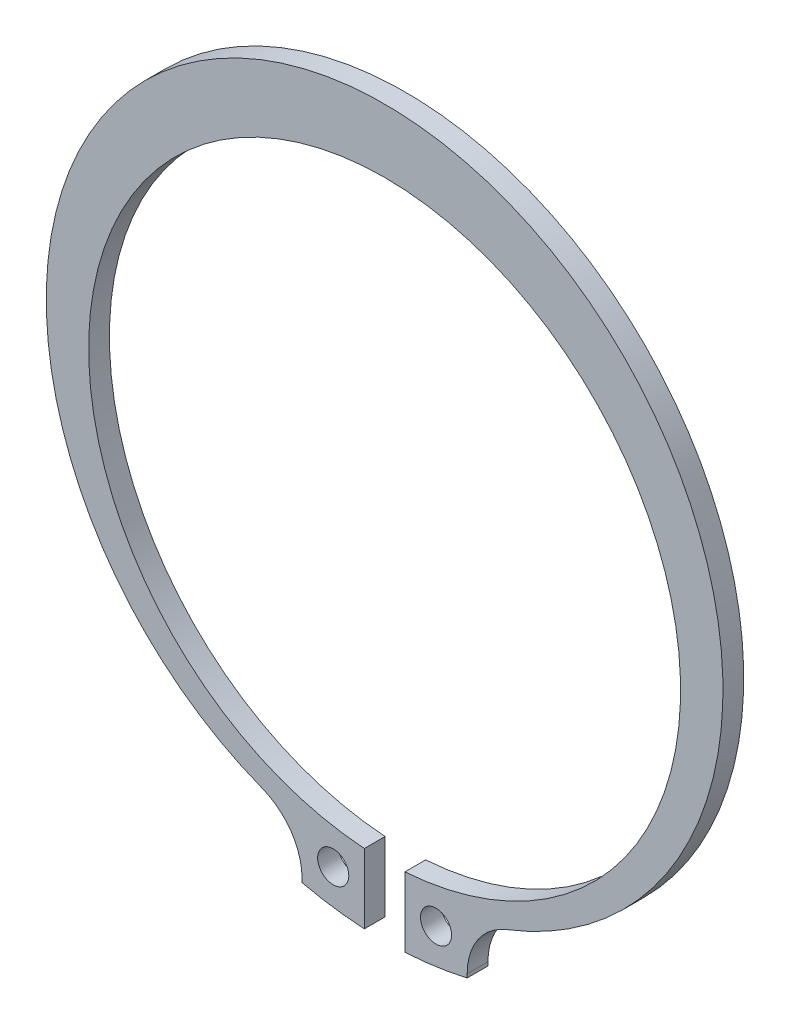
ISO-10303-21;
HEADER;
FILE_DESCRIPTION(('STEP AP214'),'2;1');
FILE_NAME('part.step','',(''),(''),'','','');
FILE_SCHEMA(('AUTOMOTIVE_DESIGN { 1 0 10303 214 1 1 1 1 }'));
ENDSEC;
DATA;
#1=APPLICATION_CONTEXT('core data for automotive mechanical design processes');
#2=APPLICATION_PROTOCOL_DEFINITION('international standard','automotive_design',2000,#1);
#3=PRODUCT_CONTEXT('',#1,'mechanical');
#4=PRODUCT('Part','Part','',(#3));
#5=PRODUCT_RELATED_PRODUCT_CATEGORY('part','',(#4));
#6=PRODUCT_DEFINITION_FORMATION('','',#4);
#7=PRODUCT_DEFINITION_CONTEXT('part definition',#1,'design');
#8=PRODUCT_DEFINITION('design','',#6,#7);
#9=PRODUCT_DEFINITION_SHAPE('','',#8);
#10=(LENGTH_UNIT() NAMED_UNIT(*) SI_UNIT(.MILLI.,.METRE.));
#11=(NAMED_UNIT(*) PLANE_ANGLE_UNIT() SI_UNIT($,.RADIAN.));
#12=(NAMED_UNIT(*) SI_UNIT($,.STERADIAN.) SOLID_ANGLE_UNIT());
#13=UNCERTAINTY_MEASURE_WITH_UNIT(LENGTH_MEASURE(1.E-05),#10,'distance_accuracy_value','');
#14=(GEOMETRIC_REPRESENTATION_CONTEXT(3) GLOBAL_UNCERTAINTY_ASSIGNED_CONTEXT((#13)) GLOBAL_UNIT_ASSIGNED_CONTEXT((#10,
#11,#12)) REPRESENTATION_CONTEXT('',''));
#15=CARTESIAN_POINT('',(0.,0.,0.));
#16=DIRECTION('',(0.,0.,1.));
#17=DIRECTION('',(1.,0.,0.));
#18=AXIS2_PLACEMENT_3D('',#15,#16,#17);
#19=CARTESIAN_POINT('',(9.9,-5.85070601971,0.));
#20=DIRECTION('',(1.,0.,0.));
#21=DIRECTION('',(0.,0.,-1.));
#22=AXIS2_PLACEMENT_3D('',#19,#20,#21);
#23=PLANE('',#22);
#24=DIRECTION('',(0.,0.,1.));
#25=VECTOR('',#24,1.);
#26=CARTESIAN_POINT('',(9.89999999998941,-5.8507060196643,0.));
#27=LINE('',#26,#25);
#28=CARTESIAN_POINT('',(9.89999999999471,-5.85070601966307,0.));
#29=VERTEX_POINT('',#28);
#30=CARTESIAN_POINT('',(9.89999999999471,-5.85070601966307,2.));
#31=VERTEX_POINT('',#30);
#32=EDGE_CURVE('E96',#29,#31,#27,.T.);
#33=ORIENTED_EDGE('',*,*,#32,.F.);
#34=DIRECTION('',(0.,1.,0.));
#35=VECTOR('',#34,1.);
#36=CARTESIAN_POINT('',(9.9,0.,0.));
#37=LINE('',#36,#35);
#38=CARTESIAN_POINT('',(9.9,-5.49641347023,0.));
#39=VERTEX_POINT('',#38);
#40=EDGE_CURVE('E99',#29,#39,#37,.T.);
#41=ORIENTED_EDGE('',*,*,#40,.T.);
#42=DIRECTION('',(0.,0.,1.));
#43=VECTOR('',#42,1.);
#44=CARTESIAN_POINT('',(9.9,-5.49641347023,0.));
#45=LINE('',#44,#43);
#46=CARTESIAN_POINT('',(9.9,-5.49641347023,2.));
#47=VERTEX_POINT('',#46);
#48=EDGE_CURVE('E119',#39,#47,#45,.T.);
#49=ORIENTED_EDGE('',*,*,#48,.T.);
#50=DIRECTION('',(0.,1.,0.));
#51=VECTOR('',#50,1.);
#52=CARTESIAN_POINT('',(9.9,-5.85070601971,2.));
#53=LINE('',#52,#51);
#54=EDGE_CURVE('E101',#47,#31,#53,.F.);
#55=ORIENTED_EDGE('',*,*,#54,.T.);
#56=EDGE_LOOP('',(#33,#41,#49,#55));
#57=FACE_BOUND('',#56,.T.);
#58=ADVANCED_FACE('F17',(#57),#23,.T.);
#59=CARTESIAN_POINT('',(-6.,-5.49641347023,0.));
#60=DIRECTION('',(-1.,0.,0.));
#61=DIRECTION('',(0.,0.,1.));
#62=AXIS2_PLACEMENT_3D('',#59,#60,#61);
#63=PLANE('',#62);
#64=DIRECTION('',(0.,0.,1.));
#65=VECTOR('',#64,1.);
#66=CARTESIAN_POINT('',(-6.,-5.49641347023,0.));
#67=LINE('',#66,#65);
#68=CARTESIAN_POINT('',(-6.,-5.49641347023,2.));
#69=VERTEX_POINT('',#68);
#70=CARTESIAN_POINT('',(-6.,-5.49641347023,0.));
#71=VERTEX_POINT('',#70);
#72=EDGE_CURVE('E175',#69,#71,#67,.F.);
#73=ORIENTED_EDGE('',*,*,#72,.T.);
#74=DIRECTION('',(0.,1.,0.));
#75=VECTOR('',#74,1.);
#76=CARTESIAN_POINT('',(-6.,0.,0.));
#77=LINE('',#76,#75);
#78=CARTESIAN_POINT('',(-5.99999999999471,-5.85070601966307,0.));
#79=VERTEX_POINT('',#78);
#80=EDGE_CURVE('E115',#71,#79,#77,.F.);
#81=ORIENTED_EDGE('',*,*,#80,.T.);
#82=DIRECTION('',(0.,0.,1.));
#83=VECTOR('',#82,1.);
#84=CARTESIAN_POINT('',(-5.99999999998942,-5.85070601966429,0.));
#85=LINE('',#84,#83);
#86=CARTESIAN_POINT('',(-5.99999999999471,-5.85070601966307,2.));
#87=VERTEX_POINT('',#86);
#88=EDGE_CURVE('E162',#87,#79,#85,.F.);
#89=ORIENTED_EDGE('',*,*,#88,.F.);
#90=DIRECTION('',(0.,1.,0.));
#91=VECTOR('',#90,1.);
#92=CARTESIAN_POINT('',(-6.,-5.49641347023,2.));
#93=LINE('',#92,#91);
#94=EDGE_CURVE('E116',#87,#69,#93,.T.);
#95=ORIENTED_EDGE('',*,*,#94,.T.);
#96=EDGE_LOOP('',(#73,#81,#89,#95));
#97=FACE_BOUND('',#96,.T.);
#98=ADVANCED_FACE('F211',(#97),#63,.T.);
#99=CARTESIAN_POINT('',(0.,0.,0.));
#100=DIRECTION('',(0.,0.,1.));
#101=DIRECTION('',(1.,0.,0.));
#102=AXIS2_PLACEMENT_3D('',#99,#100,#101);
#103=PLANE('',#102);
#104=CARTESIAN_POINT('',(6.9,-3.02654355576,0.));
#105=DIRECTION('',(0.,0.,-1.));
#106=DIRECTION('',(-1.,0.,0.));
#107=AXIS2_PLACEMENT_3D('',#104,#105,#106);
#108=CIRCLE('',#107,1.5);
#109=CARTESIAN_POINT('',(5.4,-3.02654355576,0.));
#110=VERTEX_POINT('',#109);
#111=EDGE_CURVE('E152',#110,#110,#108,.F.);
#112=ORIENTED_EDGE('',*,*,#111,.T.);
#113=EDGE_LOOP('',(#112));
#114=FACE_BOUND('',#113,.T.);
#115=CARTESIAN_POINT('',(-3.,-3.02654355576,0.));
#116=DIRECTION('',(0.,0.,1.));
#117=DIRECTION('',(1.,0.,0.));
#118=AXIS2_PLACEMENT_3D('',#115,#116,#117);
#119=CIRCLE('',#118,1.5);
#120=CARTESIAN_POINT('',(-1.5,-3.02654355576,0.));
#121=VERTEX_POINT('',#120);
#122=EDGE_CURVE('E155',#121,#121,#119,.T.);
#123=ORIENTED_EDGE('',*,*,#122,.T.);
#124=EDGE_LOOP('',(#123));
#125=FACE_BOUND('',#124,.T.);
#126=CARTESIAN_POINT('',(1.95,28.4332112151,0.));
#127=DIRECTION('',(0.,0.,1.));
#128=DIRECTION('',(1.,0.,0.));
#129=AXIS2_PLACEMENT_3D('',#126,#127,#128);
#130=CIRCLE('',#129,35.1936);
#131=CARTESIAN_POINT('',(0.,-6.7063246520891,0.));
#132=VERTEX_POINT('',#131);
#133=EDGE_CURVE('E160',#79,#132,#130,.T.);
#134=ORIENTED_EDGE('',*,*,#133,.F.);
#135=ORIENTED_EDGE('',*,*,#80,.F.);
#136=CARTESIAN_POINT('',(-12.,-5.49641347023,0.));
#137=DIRECTION('',(0.,0.,1.));
#138=DIRECTION('',(1.,0.,0.));
#139=AXIS2_PLACEMENT_3D('',#136,#137,#138);
#140=CIRCLE('',#139,6.);
#141=CARTESIAN_POINT('',(-9.83048211508956,0.0976183626302442,0.));
#142=VERTEX_POINT('',#141);
#143=EDGE_CURVE('E163',#71,#142,#140,.T.);
#144=ORIENTED_EDGE('',*,*,#143,.T.);
#145=CARTESIAN_POINT('',(1.95,30.4732112151,0.));
#146=DIRECTION('',(0.,0.,1.));
#147=DIRECTION('',(1.,0.,0.));
#148=AXIS2_PLACEMENT_3D('',#145,#146,#147);
#149=CIRCLE('',#148,32.58);
#150=CARTESIAN_POINT('',(13.7304821150857,0.0976183626530914,0.));
#151=VERTEX_POINT('',#150);
#152=EDGE_CURVE('E166',#151,#142,#149,.T.);
#153=ORIENTED_EDGE('',*,*,#152,.F.);
#154=CARTESIAN_POINT('',(15.9,-5.49641347023,0.));
#155=DIRECTION('',(0.,0.,1.));
#156=DIRECTION('',(1.,0.,0.));
#157=AXIS2_PLACEMENT_3D('',#154,#155,#156);
#158=CIRCLE('',#157,6.);
#159=EDGE_CURVE('E113',#151,#39,#158,.T.);
#160=ORIENTED_EDGE('',*,*,#159,.T.);
#161=ORIENTED_EDGE('',*,*,#40,.F.);
#162=CARTESIAN_POINT('',(1.95,28.4332112151,0.));
#163=DIRECTION('',(0.,0.,1.));
#164=DIRECTION('',(1.,0.,0.));
#165=AXIS2_PLACEMENT_3D('',#162,#163,#164);
#166=CIRCLE('',#165,35.1936);
#167=CARTESIAN_POINT('',(3.89999999999884,-6.70632465206826,0.));
#168=VERTEX_POINT('',#167);
#169=EDGE_CURVE('E20',#168,#29,#166,.T.);
#170=ORIENTED_EDGE('',*,*,#169,.F.);
#171=DIRECTION('',(0.,1.,0.));
#172=VECTOR('',#171,1.);
#173=CARTESIAN_POINT('',(3.9,0.,0.));
#174=LINE('',#173,#172);
#175=CARTESIAN_POINT('',(3.8999999999985,4.36543162729564E-11,0.));
#176=VERTEX_POINT('',#175);
#177=EDGE_CURVE('E91',#176,#168,#174,.F.);
#178=ORIENTED_EDGE('',*,*,#177,.F.);
#179=CARTESIAN_POINT('',(1.95,28.4332112151,0.));
#180=DIRECTION('',(0.,0.,1.));
#181=DIRECTION('',(1.,0.,0.));
#182=AXIS2_PLACEMENT_3D('',#179,#180,#181);
#183=CIRCLE('',#182,28.5);
#184=CARTESIAN_POINT('',(1.49294639151254E-12,4.36543162729564E-11,0.));
#185=VERTEX_POINT('',#184);
#186=EDGE_CURVE('E127',#176,#185,#183,.T.);
#187=ORIENTED_EDGE('',*,*,#186,.T.);
#188=DIRECTION('',(0.,1.,0.));
#189=VECTOR('',#188,1.);
#190=CARTESIAN_POINT('',(0.,-6.70632465211,0.));
#191=LINE('',#190,#189);
#192=EDGE_CURVE('E125',#132,#185,#191,.T.);
#193=ORIENTED_EDGE('',*,*,#192,.F.);
#194=EDGE_LOOP('',(#134,#135,#144,#153,#160,#161,#170,#178,#187,#193));
#195=FACE_BOUND('',#194,.T.);
#196=ADVANCED_FACE('F110',(#114,#125,#195),#103,.F.);
#197=CARTESIAN_POINT('',(3.9,0.,0.));
#198=DIRECTION('',(-1.,0.,0.));
#199=DIRECTION('',(0.,0.,1.));
#200=AXIS2_PLACEMENT_3D('',#197,#198,#199);
#201=PLANE('',#200);
#202=DIRECTION('',(0.,0.,1.));
#203=VECTOR('',#202,1.);
#204=CARTESIAN_POINT('',(3.899999999997,4.35519675878737E-11,0.));
#205=LINE('',#204,#203);
#206=CARTESIAN_POINT('',(3.8999999999985,4.36543162729564E-11,2.));
#207=VERTEX_POINT('',#206);
#208=EDGE_CURVE('E158',#207,#176,#205,.F.);
#209=ORIENTED_EDGE('',*,*,#208,.T.);
#210=ORIENTED_EDGE('',*,*,#177,.T.);
#211=DIRECTION('',(0.,0.,1.));
#212=VECTOR('',#211,1.);
#213=CARTESIAN_POINT('',(3.89999999999767,-6.70632465206833,0.));
#214=LINE('',#213,#212);
#215=CARTESIAN_POINT('',(3.89999999999884,-6.70632465206826,2.));
#216=VERTEX_POINT('',#215);
#217=EDGE_CURVE('E106',#216,#168,#214,.F.);
#218=ORIENTED_EDGE('',*,*,#217,.F.);
#219=DIRECTION('',(0.,1.,0.));
#220=VECTOR('',#219,1.);
#221=CARTESIAN_POINT('',(3.9,0.,2.));
#222=LINE('',#221,#220);
#223=EDGE_CURVE('E151',#207,#216,#222,.F.);
#224=ORIENTED_EDGE('',*,*,#223,.F.);
#225=EDGE_LOOP('',(#209,#210,#218,#224));
#226=FACE_BOUND('',#225,.T.);
#227=ADVANCED_FACE('F200',(#226),#201,.T.);
#228=CARTESIAN_POINT('',(1.95,28.4332112151,0.));
#229=DIRECTION('',(0.,0.,1.));
#230=DIRECTION('',(1.,0.,0.));
#231=AXIS2_PLACEMENT_3D('',#228,#229,#230);
#232=CYLINDRICAL_SURFACE('',#231,35.1936);
#233=ORIENTED_EDGE('',*,*,#217,.T.);
#234=ORIENTED_EDGE('',*,*,#169,.T.);
#235=ORIENTED_EDGE('',*,*,#32,.T.);
#236=CARTESIAN_POINT('',(1.95,28.4332112151,2.));
#237=DIRECTION('',(0.,0.,1.));
#238=DIRECTION('',(1.,0.,0.));
#239=AXIS2_PLACEMENT_3D('',#236,#237,#238);
#240=CIRCLE('',#239,35.1936);
#241=EDGE_CURVE('E149',#216,#31,#240,.T.);
#242=ORIENTED_EDGE('',*,*,#241,.F.);
#243=EDGE_LOOP('',(#233,#234,#235,#242));
#244=FACE_BOUND('',#243,.T.);
#245=ADVANCED_FACE('F118',(#244),#232,.T.);
#246=CARTESIAN_POINT('',(15.9,-5.49641347023,0.));
#247=DIRECTION('',(0.,0.,1.));
#248=DIRECTION('',(1.,0.,0.));
#249=AXIS2_PLACEMENT_3D('',#246,#247,#248);
#250=CYLINDRICAL_SURFACE('',#249,6.);
#251=CARTESIAN_POINT('',(15.9,-5.49641347023,2.));
#252=DIRECTION('',(0.,0.,1.));
#253=DIRECTION('',(1.,0.,0.));
#254=AXIS2_PLACEMENT_3D('',#251,#252,#253);
#255=CIRCLE('',#254,6.);
#256=CARTESIAN_POINT('',(13.7304821150775,0.0976183626742455,2.));
#257=VERTEX_POINT('',#256);
#258=EDGE_CURVE('E146',#47,#257,#255,.F.);
#259=ORIENTED_EDGE('',*,*,#258,.F.);
#260=ORIENTED_EDGE('',*,*,#48,.F.);
#261=ORIENTED_EDGE('',*,*,#159,.F.);
#262=DIRECTION('',(0.,0.,1.));
#263=VECTOR('',#262,1.);
#264=CARTESIAN_POINT('',(13.7304821150834,0.0976183626765111,0.));
#265=LINE('',#264,#263);
#266=EDGE_CURVE('E168',#257,#151,#265,.F.);
#267=ORIENTED_EDGE('',*,*,#266,.F.);
#268=EDGE_LOOP('',(#259,#260,#261,#267));
#269=FACE_BOUND('',#268,.T.);
#270=ADVANCED_FACE('F203',(#269),#250,.F.);
#271=CARTESIAN_POINT('',(1.95,30.4732112151,0.));
#272=DIRECTION('',(0.,0.,1.));
#273=DIRECTION('',(1.,0.,0.));
#274=AXIS2_PLACEMENT_3D('',#271,#272,#273);
#275=CYLINDRICAL_SURFACE('',#274,32.58);
#276=ORIENTED_EDGE('',*,*,#266,.T.);
#277=ORIENTED_EDGE('',*,*,#152,.T.);
#278=DIRECTION('',(0.,0.,1.));
#279=VECTOR('',#278,1.);
#280=CARTESIAN_POINT('',(-9.83048211509104,0.0976183626308167,0.));
#281=LINE('',#280,#279);
#282=CARTESIAN_POINT('',(-9.83048211508956,0.0976183626302442,2.));
#283=VERTEX_POINT('',#282);
#284=EDGE_CURVE('E165',#142,#283,#281,.T.);
#285=ORIENTED_EDGE('',*,*,#284,.T.);
#286=CARTESIAN_POINT('',(1.95,30.4732112151,2.));
#287=DIRECTION('',(0.,0.,1.));
#288=DIRECTION('',(1.,0.,0.));
#289=AXIS2_PLACEMENT_3D('',#286,#287,#288);
#290=CIRCLE('',#289,32.58);
#291=EDGE_CURVE('E143',#257,#283,#290,.T.);
#292=ORIENTED_EDGE('',*,*,#291,.F.);
#293=EDGE_LOOP('',(#276,#277,#285,#292));
#294=FACE_BOUND('',#293,.T.);
#295=ADVANCED_FACE('F204',(#294),#275,.T.);
#296=CARTESIAN_POINT('',(-12.,-5.49641347023,0.));
#297=DIRECTION('',(0.,0.,1.));
#298=DIRECTION('',(1.,0.,0.));
#299=AXIS2_PLACEMENT_3D('',#296,#297,#298);
#300=CYLINDRICAL_SURFACE('',#299,6.);
#301=CARTESIAN_POINT('',(-12.,-5.49641347023,2.));
#302=DIRECTION('',(0.,0.,1.));
#303=DIRECTION('',(1.,0.,0.));
#304=AXIS2_PLACEMENT_3D('',#301,#302,#303);
#305=CIRCLE('',#304,6.);
#306=EDGE_CURVE('E140',#283,#69,#305,.F.);
#307=ORIENTED_EDGE('',*,*,#306,.F.);
#308=ORIENTED_EDGE('',*,*,#284,.F.);
#309=ORIENTED_EDGE('',*,*,#143,.F.);
#310=ORIENTED_EDGE('',*,*,#72,.F.);
#311=EDGE_LOOP('',(#307,#308,#309,#310));
#312=FACE_BOUND('',#311,.T.);
#313=ADVANCED_FACE('F208',(#312),#300,.F.);
#314=CARTESIAN_POINT('',(1.95,28.4332112151,0.));
#315=DIRECTION('',(0.,0.,1.));
#316=DIRECTION('',(1.,0.,0.));
#317=AXIS2_PLACEMENT_3D('',#314,#315,#316);
#318=CYLINDRICAL_SURFACE('',#317,35.1936);
#319=ORIENTED_EDGE('',*,*,#88,.T.);
#320=ORIENTED_EDGE('',*,*,#133,.T.);
#321=DIRECTION('',(0.,0.,-1.));
#322=VECTOR('',#321,1.);
#323=CARTESIAN_POINT('',(0.,-6.70632465211,0.));
#324=LINE('',#323,#322);
#325=CARTESIAN_POINT('',(0.,-6.7063246520891,2.));
#326=VERTEX_POINT('',#325);
#327=EDGE_CURVE('E128',#326,#132,#324,.T.);
#328=ORIENTED_EDGE('',*,*,#327,.F.);
#329=CARTESIAN_POINT('',(1.95,28.4332112151,2.));
#330=DIRECTION('',(0.,0.,1.));
#331=DIRECTION('',(1.,0.,0.));
#332=AXIS2_PLACEMENT_3D('',#329,#330,#331);
#333=CIRCLE('',#332,35.1936);
#334=EDGE_CURVE('E137',#87,#326,#333,.T.);
#335=ORIENTED_EDGE('',*,*,#334,.F.);
#336=EDGE_LOOP('',(#319,#320,#328,#335));
#337=FACE_BOUND('',#336,.T.);
#338=ADVANCED_FACE('F194',(#337),#318,.T.);
#339=CARTESIAN_POINT('',(0.,-6.70632465211,0.));
#340=DIRECTION('',(1.,0.,0.));
#341=DIRECTION('',(0.,0.,-1.));
#342=AXIS2_PLACEMENT_3D('',#339,#340,#341);
#343=PLANE('',#342);
#344=ORIENTED_EDGE('',*,*,#327,.T.);
#345=ORIENTED_EDGE('',*,*,#192,.T.);
#346=DIRECTION('',(0.,0.,1.));
#347=VECTOR('',#346,1.);
#348=CARTESIAN_POINT('',(2.98589278302508E-12,4.35519675878737E-11,0.));
#349=LINE('',#348,#347);
#350=CARTESIAN_POINT('',(1.49294639151254E-12,4.36543162729564E-11,2.));
#351=VERTEX_POINT('',#350);
#352=EDGE_CURVE('E35',#185,#351,#349,.T.);
#353=ORIENTED_EDGE('',*,*,#352,.T.);
#354=DIRECTION('',(0.,1.,0.));
#355=VECTOR('',#354,1.);
#356=CARTESIAN_POINT('',(0.,0.,2.));
#357=LINE('',#356,#355);
#358=EDGE_CURVE('E136',#326,#351,#357,.T.);
#359=ORIENTED_EDGE('',*,*,#358,.F.);
#360=EDGE_LOOP('',(#344,#345,#353,#359));
#361=FACE_BOUND('',#360,.T.);
#362=ADVANCED_FACE('F191',(#361),#343,.T.);
#363=CARTESIAN_POINT('',(1.95,28.4332112151,0.));
#364=DIRECTION('',(0.,0.,1.));
#365=DIRECTION('',(1.,0.,0.));
#366=AXIS2_PLACEMENT_3D('',#363,#364,#365);
#367=CYLINDRICAL_SURFACE('',#366,28.5);
#368=CARTESIAN_POINT('',(1.95,28.4332112151,2.));
#369=DIRECTION('',(0.,0.,1.));
#370=DIRECTION('',(1.,0.,0.));
#371=AXIS2_PLACEMENT_3D('',#368,#369,#370);
#372=CIRCLE('',#371,28.5);
#373=EDGE_CURVE('E133',#351,#207,#372,.F.);
#374=ORIENTED_EDGE('',*,*,#373,.F.);
#375=ORIENTED_EDGE('',*,*,#352,.F.);
#376=ORIENTED_EDGE('',*,*,#186,.F.);
#377=ORIENTED_EDGE('',*,*,#208,.F.);
#378=EDGE_LOOP('',(#374,#375,#376,#377));
#379=FACE_BOUND('',#378,.T.);
#380=ADVANCED_FACE('F199',(#379),#367,.F.);
#381=CARTESIAN_POINT('',(-3.,-3.02654355576,2.));
#382=DIRECTION('',(0.,0.,1.));
#383=DIRECTION('',(1.,0.,0.));
#384=AXIS2_PLACEMENT_3D('',#381,#382,#383);
#385=CYLINDRICAL_SURFACE('',#384,1.5);
#386=CARTESIAN_POINT('',(-3.,-3.02654355576,2.));
#387=DIRECTION('',(0.,0.,1.));
#388=DIRECTION('',(1.,0.,0.));
#389=AXIS2_PLACEMENT_3D('',#386,#387,#388);
#390=CIRCLE('',#389,1.5);
#391=CARTESIAN_POINT('',(-1.5,-3.02654355576,2.));
#392=VERTEX_POINT('',#391);
#393=EDGE_CURVE('E26',#392,#392,#390,.F.);
#394=ORIENTED_EDGE('',*,*,#393,.F.);
#395=EDGE_LOOP('',(#394));
#396=FACE_BOUND('',#395,.T.);
#397=ORIENTED_EDGE('',*,*,#122,.F.);
#398=EDGE_LOOP('',(#397));
#399=FACE_BOUND('',#398,.T.);
#400=ADVANCED_FACE('F227',(#396,#399),#385,.F.);
#401=CARTESIAN_POINT('',(6.9,-3.02654355576,2.));
#402=DIRECTION('',(0.,0.,-1.));
#403=DIRECTION('',(-1.,0.,0.));
#404=AXIS2_PLACEMENT_3D('',#401,#402,#403);
#405=CYLINDRICAL_SURFACE('',#404,1.5);
#406=CARTESIAN_POINT('',(6.9,-3.02654355576,2.));
#407=DIRECTION('',(0.,0.,-1.));
#408=DIRECTION('',(-1.,0.,0.));
#409=AXIS2_PLACEMENT_3D('',#406,#407,#408);
#410=CIRCLE('',#409,1.5);
#411=CARTESIAN_POINT('',(5.4,-3.02654355576,2.));
#412=VERTEX_POINT('',#411);
#413=EDGE_CURVE('E11',#412,#412,#410,.T.);
#414=ORIENTED_EDGE('',*,*,#413,.F.);
#415=EDGE_LOOP('',(#414));
#416=FACE_BOUND('',#415,.T.);
#417=ORIENTED_EDGE('',*,*,#111,.F.);
#418=EDGE_LOOP('',(#417));
#419=FACE_BOUND('',#418,.T.);
#420=ADVANCED_FACE('F221',(#416,#419),#405,.F.);
#421=CARTESIAN_POINT('',(0.,0.,2.));
#422=DIRECTION('',(0.,0.,1.));
#423=DIRECTION('',(1.,0.,0.));
#424=AXIS2_PLACEMENT_3D('',#421,#422,#423);
#425=PLANE('',#424);
#426=ORIENTED_EDGE('',*,*,#413,.T.);
#427=EDGE_LOOP('',(#426));
#428=FACE_BOUND('',#427,.T.);
#429=ORIENTED_EDGE('',*,*,#393,.T.);
#430=EDGE_LOOP('',(#429));
#431=FACE_BOUND('',#430,.T.);
#432=ORIENTED_EDGE('',*,*,#358,.T.);
#433=ORIENTED_EDGE('',*,*,#373,.T.);
#434=ORIENTED_EDGE('',*,*,#223,.T.);
#435=ORIENTED_EDGE('',*,*,#241,.T.);
#436=ORIENTED_EDGE('',*,*,#54,.F.);
#437=ORIENTED_EDGE('',*,*,#258,.T.);
#438=ORIENTED_EDGE('',*,*,#291,.T.);
#439=ORIENTED_EDGE('',*,*,#306,.T.);
#440=ORIENTED_EDGE('',*,*,#94,.F.);
#441=ORIENTED_EDGE('',*,*,#334,.T.);
#442=EDGE_LOOP('',(#432,#433,#434,#435,#436,#437,#438,#439,#440,#441));
#443=FACE_BOUND('',#442,.T.);
#444=ADVANCED_FACE('F189',(#428,#431,#443),#425,.T.);
#445=CLOSED_SHELL('',(#58,#98,#196,#227,#245,#270,#295,#313,#338,#362,#380,#400,#420,#444));
#446=MANIFOLD_SOLID_BREP('B1',#445);
#447=ADVANCED_BREP_SHAPE_REPRESENTATION('',(#18,#446),#14);
#448=SHAPE_DEFINITION_REPRESENTATION(#9,#447);
ENDSEC;
END-ISO-10303-21;
